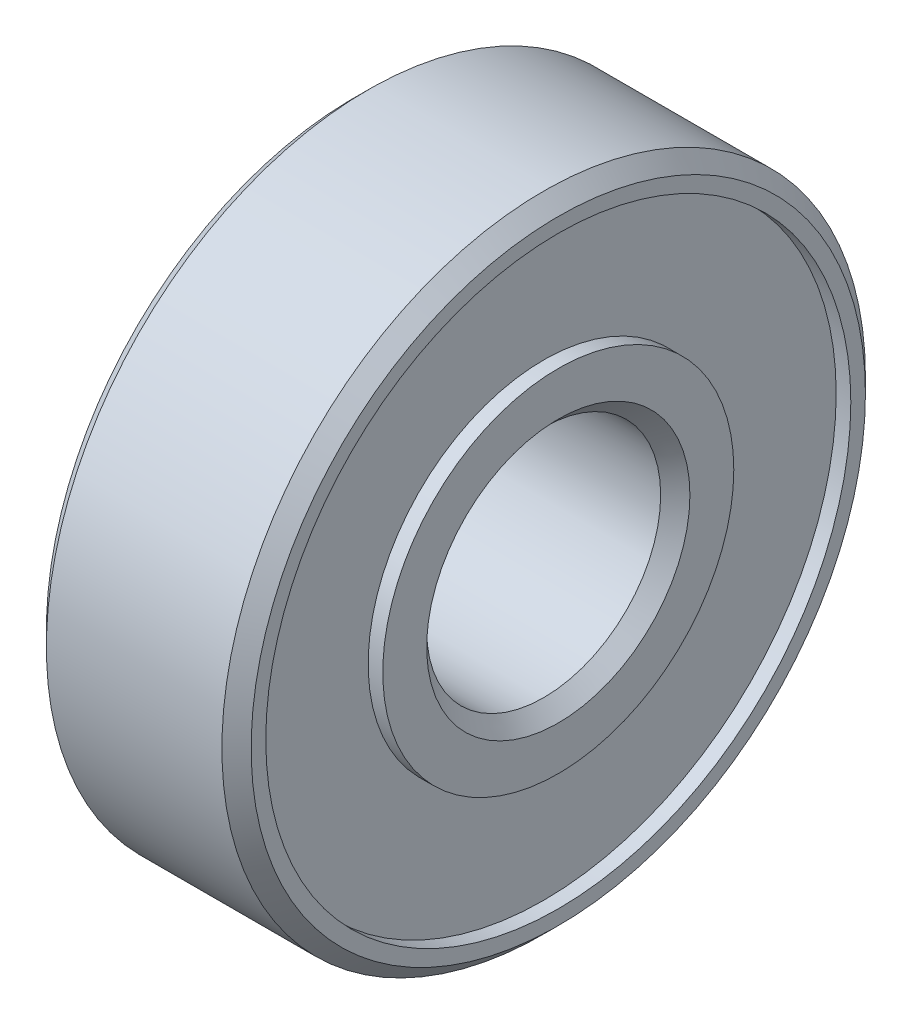
ISO-10303-21;
HEADER;
FILE_DESCRIPTION(('STEP AP214'),'2;1');
FILE_NAME('part.step','',(''),(''),'','','');
FILE_SCHEMA(('AUTOMOTIVE_DESIGN { 1 0 10303 214 1 1 1 1 }'));
ENDSEC;
DATA;
#1=APPLICATION_CONTEXT('core data for automotive mechanical design processes');
#2=APPLICATION_PROTOCOL_DEFINITION('international standard','automotive_design',2000,#1);
#3=PRODUCT_CONTEXT('',#1,'mechanical');
#4=PRODUCT('Part','Part','',(#3));
#5=PRODUCT_RELATED_PRODUCT_CATEGORY('part','',(#4));
#6=PRODUCT_DEFINITION_FORMATION('','',#4);
#7=PRODUCT_DEFINITION_CONTEXT('part definition',#1,'design');
#8=PRODUCT_DEFINITION('design','',#6,#7);
#9=PRODUCT_DEFINITION_SHAPE('','',#8);
#10=(LENGTH_UNIT() NAMED_UNIT(*) SI_UNIT(.MILLI.,.METRE.));
#11=(NAMED_UNIT(*) PLANE_ANGLE_UNIT() SI_UNIT($,.RADIAN.));
#12=(NAMED_UNIT(*) SI_UNIT($,.STERADIAN.) SOLID_ANGLE_UNIT());
#13=UNCERTAINTY_MEASURE_WITH_UNIT(LENGTH_MEASURE(1.E-05),#10,'distance_accuracy_value','');
#14=(GEOMETRIC_REPRESENTATION_CONTEXT(3) GLOBAL_UNCERTAINTY_ASSIGNED_CONTEXT((#13)) GLOBAL_UNIT_ASSIGNED_CONTEXT((#10,
#11,#12)) REPRESENTATION_CONTEXT('',''));
#15=CARTESIAN_POINT('',(0.,0.,0.));
#16=DIRECTION('',(0.,0.,1.));
#17=DIRECTION('',(1.,0.,0.));
#18=AXIS2_PLACEMENT_3D('',#15,#16,#17);
#19=CARTESIAN_POINT('',(-3.,6.,0.));
#20=DIRECTION('',(-1.,0.,0.));
#21=DIRECTION('',(0.,0.,1.));
#22=AXIS2_PLACEMENT_3D('',#19,#20,#21);
#23=PLANE('',#22);
#24=CARTESIAN_POINT('',(-3.,0.,0.));
#25=DIRECTION('',(1.,0.,0.));
#26=DIRECTION('',(0.,0.,-1.));
#27=AXIS2_PLACEMENT_3D('',#24,#25,#26);
#28=CIRCLE('',#27,6.);
#29=CARTESIAN_POINT('',(-3.,0.,-6.));
#30=VERTEX_POINT('',#29);
#31=EDGE_CURVE('E10',#30,#30,#28,.T.);
#32=ORIENTED_EDGE('',*,*,#31,.T.);
#33=EDGE_LOOP('',(#32));
#34=FACE_BOUND('',#33,.T.);
#35=CARTESIAN_POINT('',(-3.,0.,0.));
#36=DIRECTION('',(1.,0.,0.));
#37=DIRECTION('',(0.,0.,-1.));
#38=AXIS2_PLACEMENT_3D('',#35,#36,#37);
#39=CIRCLE('',#38,10.);
#40=CARTESIAN_POINT('',(-3.,0.,-10.));
#41=VERTEX_POINT('',#40);
#42=EDGE_CURVE('E83',#41,#41,#39,.T.);
#43=ORIENTED_EDGE('',*,*,#42,.F.);
#44=EDGE_LOOP('',(#43));
#45=FACE_BOUND('',#44,.T.);
#46=ADVANCED_FACE('F31',(#34,#45),#23,.T.);
#47=CARTESIAN_POINT('',(0.,0.,0.));
#48=DIRECTION('',(1.,0.,0.));
#49=DIRECTION('',(0.,0.,-1.));
#50=AXIS2_PLACEMENT_3D('',#47,#48,#49);
#51=CYLINDRICAL_SURFACE('',#50,6.);
#52=CARTESIAN_POINT('',(-3.5,0.,0.));
#53=DIRECTION('',(1.,0.,0.));
#54=DIRECTION('',(0.,0.,-1.));
#55=AXIS2_PLACEMENT_3D('',#52,#53,#54);
#56=CIRCLE('',#55,6.);
#57=CARTESIAN_POINT('',(-3.5,0.,-6.));
#58=VERTEX_POINT('',#57);
#59=EDGE_CURVE('E37',#58,#58,#56,.T.);
#60=ORIENTED_EDGE('',*,*,#59,.T.);
#61=EDGE_LOOP('',(#60));
#62=FACE_BOUND('',#61,.T.);
#63=ORIENTED_EDGE('',*,*,#31,.F.);
#64=EDGE_LOOP('',(#63));
#65=FACE_BOUND('',#64,.T.);
#66=ADVANCED_FACE('F91',(#62,#65),#51,.T.);
#67=CARTESIAN_POINT('',(-3.5,4.5,0.));
#68=DIRECTION('',(-1.,0.,0.));
#69=DIRECTION('',(0.,0.,1.));
#70=AXIS2_PLACEMENT_3D('',#67,#68,#69);
#71=PLANE('',#70);
#72=CARTESIAN_POINT('',(-3.5,0.,0.));
#73=DIRECTION('',(1.,0.,0.));
#74=DIRECTION('',(0.,0.,-1.));
#75=AXIS2_PLACEMENT_3D('',#72,#73,#74);
#76=CIRCLE('',#75,4.5);
#77=CARTESIAN_POINT('',(-3.5,0.,-4.5));
#78=VERTEX_POINT('',#77);
#79=EDGE_CURVE('E41',#78,#78,#76,.T.);
#80=ORIENTED_EDGE('',*,*,#79,.T.);
#81=EDGE_LOOP('',(#80));
#82=FACE_BOUND('',#81,.T.);
#83=ORIENTED_EDGE('',*,*,#59,.F.);
#84=EDGE_LOOP('',(#83));
#85=FACE_BOUND('',#84,.T.);
#86=ADVANCED_FACE('F95',(#82,#85),#71,.T.);
#87=CARTESIAN_POINT('',(-3.5,0.,0.));
#88=DIRECTION('',(-1.,0.,0.));
#89=DIRECTION('',(0.,0.,1.));
#90=AXIS2_PLACEMENT_3D('',#87,#88,#89);
#91=CONICAL_SURFACE('',#90,4.5,0.785398163397448);
#92=CARTESIAN_POINT('',(-3.,0.,0.));
#93=DIRECTION('',(1.,0.,0.));
#94=DIRECTION('',(0.,0.,-1.));
#95=AXIS2_PLACEMENT_3D('',#92,#93,#94);
#96=CIRCLE('',#95,4.);
#97=CARTESIAN_POINT('',(-3.,0.,-4.));
#98=VERTEX_POINT('',#97);
#99=EDGE_CURVE('E45',#98,#98,#96,.T.);
#100=ORIENTED_EDGE('',*,*,#99,.T.);
#101=EDGE_LOOP('',(#100));
#102=FACE_BOUND('',#101,.T.);
#103=ORIENTED_EDGE('',*,*,#79,.F.);
#104=EDGE_LOOP('',(#103));
#105=FACE_BOUND('',#104,.T.);
#106=ADVANCED_FACE('F99',(#102,#105),#91,.F.);
#107=CARTESIAN_POINT('',(0.,0.,0.));
#108=DIRECTION('',(1.,0.,0.));
#109=DIRECTION('',(0.,0.,-1.));
#110=AXIS2_PLACEMENT_3D('',#107,#108,#109);
#111=CYLINDRICAL_SURFACE('',#110,4.);
#112=CARTESIAN_POINT('',(3.,0.,0.));
#113=DIRECTION('',(1.,0.,0.));
#114=DIRECTION('',(0.,0.,-1.));
#115=AXIS2_PLACEMENT_3D('',#112,#113,#114);
#116=CIRCLE('',#115,4.);
#117=CARTESIAN_POINT('',(3.,0.,-4.));
#118=VERTEX_POINT('',#117);
#119=EDGE_CURVE('E50',#118,#118,#116,.T.);
#120=ORIENTED_EDGE('',*,*,#119,.T.);
#121=EDGE_LOOP('',(#120));
#122=FACE_BOUND('',#121,.T.);
#123=ORIENTED_EDGE('',*,*,#99,.F.);
#124=EDGE_LOOP('',(#123));
#125=FACE_BOUND('',#124,.T.);
#126=ADVANCED_FACE('F106',(#122,#125),#111,.F.);
#127=CARTESIAN_POINT('',(3.,0.,0.));
#128=DIRECTION('',(1.,0.,0.));
#129=DIRECTION('',(0.,0.,-1.));
#130=AXIS2_PLACEMENT_3D('',#127,#128,#129);
#131=CONICAL_SURFACE('',#130,4.,0.785398163397448);
#132=CARTESIAN_POINT('',(3.5,0.,0.));
#133=DIRECTION('',(1.,0.,0.));
#134=DIRECTION('',(0.,0.,-1.));
#135=AXIS2_PLACEMENT_3D('',#132,#133,#134);
#136=CIRCLE('',#135,4.5);
#137=CARTESIAN_POINT('',(3.5,0.,-4.5));
#138=VERTEX_POINT('',#137);
#139=EDGE_CURVE('E53',#138,#138,#136,.T.);
#140=ORIENTED_EDGE('',*,*,#139,.T.);
#141=EDGE_LOOP('',(#140));
#142=FACE_BOUND('',#141,.T.);
#143=ORIENTED_EDGE('',*,*,#119,.F.);
#144=EDGE_LOOP('',(#143));
#145=FACE_BOUND('',#144,.T.);
#146=ADVANCED_FACE('F110',(#142,#145),#131,.F.);
#147=CARTESIAN_POINT('',(3.5,6.,0.));
#148=DIRECTION('',(1.,0.,0.));
#149=DIRECTION('',(0.,0.,-1.));
#150=AXIS2_PLACEMENT_3D('',#147,#148,#149);
#151=PLANE('',#150);
#152=CARTESIAN_POINT('',(3.5,0.,0.));
#153=DIRECTION('',(1.,0.,0.));
#154=DIRECTION('',(0.,0.,-1.));
#155=AXIS2_PLACEMENT_3D('',#152,#153,#154);
#156=CIRCLE('',#155,6.);
#157=CARTESIAN_POINT('',(3.5,0.,-6.));
#158=VERTEX_POINT('',#157);
#159=EDGE_CURVE('E56',#158,#158,#156,.T.);
#160=ORIENTED_EDGE('',*,*,#159,.T.);
#161=EDGE_LOOP('',(#160));
#162=FACE_BOUND('',#161,.T.);
#163=ORIENTED_EDGE('',*,*,#139,.F.);
#164=EDGE_LOOP('',(#163));
#165=FACE_BOUND('',#164,.T.);
#166=ADVANCED_FACE('F114',(#162,#165),#151,.T.);
#167=CARTESIAN_POINT('',(0.,0.,0.));
#168=DIRECTION('',(1.,0.,0.));
#169=DIRECTION('',(0.,0.,-1.));
#170=AXIS2_PLACEMENT_3D('',#167,#168,#169);
#171=CYLINDRICAL_SURFACE('',#170,6.);
#172=CARTESIAN_POINT('',(3.,0.,0.));
#173=DIRECTION('',(1.,0.,0.));
#174=DIRECTION('',(0.,0.,-1.));
#175=AXIS2_PLACEMENT_3D('',#172,#173,#174);
#176=CIRCLE('',#175,6.);
#177=CARTESIAN_POINT('',(3.,0.,-6.));
#178=VERTEX_POINT('',#177);
#179=EDGE_CURVE('E59',#178,#178,#176,.T.);
#180=ORIENTED_EDGE('',*,*,#179,.T.);
#181=EDGE_LOOP('',(#180));
#182=FACE_BOUND('',#181,.T.);
#183=ORIENTED_EDGE('',*,*,#159,.F.);
#184=EDGE_LOOP('',(#183));
#185=FACE_BOUND('',#184,.T.);
#186=ADVANCED_FACE('F118',(#182,#185),#171,.T.);
#187=CARTESIAN_POINT('',(3.,10.,0.));
#188=DIRECTION('',(1.,0.,0.));
#189=DIRECTION('',(0.,0.,-1.));
#190=AXIS2_PLACEMENT_3D('',#187,#188,#189);
#191=PLANE('',#190);
#192=CARTESIAN_POINT('',(3.,0.,0.));
#193=DIRECTION('',(1.,0.,0.));
#194=DIRECTION('',(0.,0.,-1.));
#195=AXIS2_PLACEMENT_3D('',#192,#193,#194);
#196=CIRCLE('',#195,10.);
#197=CARTESIAN_POINT('',(3.,0.,-10.));
#198=VERTEX_POINT('',#197);
#199=EDGE_CURVE('E62',#198,#198,#196,.T.);
#200=ORIENTED_EDGE('',*,*,#199,.T.);
#201=EDGE_LOOP('',(#200));
#202=FACE_BOUND('',#201,.T.);
#203=ORIENTED_EDGE('',*,*,#179,.F.);
#204=EDGE_LOOP('',(#203));
#205=FACE_BOUND('',#204,.T.);
#206=ADVANCED_FACE('F122',(#202,#205),#191,.T.);
#207=CARTESIAN_POINT('',(0.,0.,0.));
#208=DIRECTION('',(1.,0.,0.));
#209=DIRECTION('',(0.,0.,-1.));
#210=AXIS2_PLACEMENT_3D('',#207,#208,#209);
#211=CYLINDRICAL_SURFACE('',#210,10.);
#212=CARTESIAN_POINT('',(3.5,0.,0.));
#213=DIRECTION('',(1.,0.,0.));
#214=DIRECTION('',(0.,0.,-1.));
#215=AXIS2_PLACEMENT_3D('',#212,#213,#214);
#216=CIRCLE('',#215,10.);
#217=CARTESIAN_POINT('',(3.5,0.,-10.));
#218=VERTEX_POINT('',#217);
#219=EDGE_CURVE('E65',#218,#218,#216,.T.);
#220=ORIENTED_EDGE('',*,*,#219,.T.);
#221=EDGE_LOOP('',(#220));
#222=FACE_BOUND('',#221,.T.);
#223=ORIENTED_EDGE('',*,*,#199,.F.);
#224=EDGE_LOOP('',(#223));
#225=FACE_BOUND('',#224,.T.);
#226=ADVANCED_FACE('F126',(#222,#225),#211,.F.);
#227=CARTESIAN_POINT('',(3.5,10.5,0.));
#228=DIRECTION('',(1.,0.,0.));
#229=DIRECTION('',(0.,0.,-1.));
#230=AXIS2_PLACEMENT_3D('',#227,#228,#229);
#231=PLANE('',#230);
#232=CARTESIAN_POINT('',(3.5,0.,0.));
#233=DIRECTION('',(1.,0.,0.));
#234=DIRECTION('',(0.,0.,-1.));
#235=AXIS2_PLACEMENT_3D('',#232,#233,#234);
#236=CIRCLE('',#235,10.5);
#237=CARTESIAN_POINT('',(3.5,0.,-10.5));
#238=VERTEX_POINT('',#237);
#239=EDGE_CURVE('E68',#238,#238,#236,.T.);
#240=ORIENTED_EDGE('',*,*,#239,.T.);
#241=EDGE_LOOP('',(#240));
#242=FACE_BOUND('',#241,.T.);
#243=ORIENTED_EDGE('',*,*,#219,.F.);
#244=EDGE_LOOP('',(#243));
#245=FACE_BOUND('',#244,.T.);
#246=ADVANCED_FACE('F130',(#242,#245),#231,.T.);
#247=CARTESIAN_POINT('',(3.5,0.,0.));
#248=DIRECTION('',(-1.,0.,0.));
#249=DIRECTION('',(0.,0.,1.));
#250=AXIS2_PLACEMENT_3D('',#247,#248,#249);
#251=CONICAL_SURFACE('',#250,10.5,0.785398163397449);
#252=CARTESIAN_POINT('',(3.,0.,0.));
#253=DIRECTION('',(1.,0.,0.));
#254=DIRECTION('',(0.,0.,-1.));
#255=AXIS2_PLACEMENT_3D('',#252,#253,#254);
#256=CIRCLE('',#255,11.);
#257=CARTESIAN_POINT('',(3.,0.,-11.));
#258=VERTEX_POINT('',#257);
#259=EDGE_CURVE('E71',#258,#258,#256,.T.);
#260=ORIENTED_EDGE('',*,*,#259,.T.);
#261=EDGE_LOOP('',(#260));
#262=FACE_BOUND('',#261,.T.);
#263=ORIENTED_EDGE('',*,*,#239,.F.);
#264=EDGE_LOOP('',(#263));
#265=FACE_BOUND('',#264,.T.);
#266=ADVANCED_FACE('F134',(#262,#265),#251,.T.);
#267=CARTESIAN_POINT('',(0.,0.,0.));
#268=DIRECTION('',(1.,0.,0.));
#269=DIRECTION('',(0.,0.,-1.));
#270=AXIS2_PLACEMENT_3D('',#267,#268,#269);
#271=CYLINDRICAL_SURFACE('',#270,11.);
#272=CARTESIAN_POINT('',(-3.,0.,0.));
#273=DIRECTION('',(1.,0.,0.));
#274=DIRECTION('',(0.,0.,-1.));
#275=AXIS2_PLACEMENT_3D('',#272,#273,#274);
#276=CIRCLE('',#275,11.);
#277=CARTESIAN_POINT('',(-3.,0.,-11.));
#278=VERTEX_POINT('',#277);
#279=EDGE_CURVE('E74',#278,#278,#276,.T.);
#280=ORIENTED_EDGE('',*,*,#279,.T.);
#281=EDGE_LOOP('',(#280));
#282=FACE_BOUND('',#281,.T.);
#283=ORIENTED_EDGE('',*,*,#259,.F.);
#284=EDGE_LOOP('',(#283));
#285=FACE_BOUND('',#284,.T.);
#286=ADVANCED_FACE('F138',(#282,#285),#271,.T.);
#287=CARTESIAN_POINT('',(-3.,0.,0.));
#288=DIRECTION('',(1.,0.,0.));
#289=DIRECTION('',(0.,0.,-1.));
#290=AXIS2_PLACEMENT_3D('',#287,#288,#289);
#291=CONICAL_SURFACE('',#290,11.,0.785398163397449);
#292=CARTESIAN_POINT('',(-3.5,0.,0.));
#293=DIRECTION('',(1.,0.,0.));
#294=DIRECTION('',(0.,0.,-1.));
#295=AXIS2_PLACEMENT_3D('',#292,#293,#294);
#296=CIRCLE('',#295,10.5);
#297=CARTESIAN_POINT('',(-3.5,0.,-10.5));
#298=VERTEX_POINT('',#297);
#299=EDGE_CURVE('E77',#298,#298,#296,.T.);
#300=ORIENTED_EDGE('',*,*,#299,.T.);
#301=EDGE_LOOP('',(#300));
#302=FACE_BOUND('',#301,.T.);
#303=ORIENTED_EDGE('',*,*,#279,.F.);
#304=EDGE_LOOP('',(#303));
#305=FACE_BOUND('',#304,.T.);
#306=ADVANCED_FACE('F142',(#302,#305),#291,.T.);
#307=CARTESIAN_POINT('',(-3.5,10.,0.));
#308=DIRECTION('',(-1.,0.,0.));
#309=DIRECTION('',(0.,0.,1.));
#310=AXIS2_PLACEMENT_3D('',#307,#308,#309);
#311=PLANE('',#310);
#312=CARTESIAN_POINT('',(-3.5,0.,0.));
#313=DIRECTION('',(1.,0.,0.));
#314=DIRECTION('',(0.,0.,-1.));
#315=AXIS2_PLACEMENT_3D('',#312,#313,#314);
#316=CIRCLE('',#315,10.);
#317=CARTESIAN_POINT('',(-3.5,0.,-10.));
#318=VERTEX_POINT('',#317);
#319=EDGE_CURVE('E80',#318,#318,#316,.T.);
#320=ORIENTED_EDGE('',*,*,#319,.T.);
#321=EDGE_LOOP('',(#320));
#322=FACE_BOUND('',#321,.T.);
#323=ORIENTED_EDGE('',*,*,#299,.F.);
#324=EDGE_LOOP('',(#323));
#325=FACE_BOUND('',#324,.T.);
#326=ADVANCED_FACE('F146',(#322,#325),#311,.T.);
#327=CARTESIAN_POINT('',(0.,0.,0.));
#328=DIRECTION('',(1.,0.,0.));
#329=DIRECTION('',(0.,0.,-1.));
#330=AXIS2_PLACEMENT_3D('',#327,#328,#329);
#331=CYLINDRICAL_SURFACE('',#330,10.);
#332=ORIENTED_EDGE('',*,*,#42,.T.);
#333=EDGE_LOOP('',(#332));
#334=FACE_BOUND('',#333,.T.);
#335=ORIENTED_EDGE('',*,*,#319,.F.);
#336=EDGE_LOOP('',(#335));
#337=FACE_BOUND('',#336,.T.);
#338=ADVANCED_FACE('F87',(#334,#337),#331,.F.);
#339=CLOSED_SHELL('',(#46,#66,#86,#106,#126,#146,#166,#186,#206,#226,#246,#266,#286,#306,#326,#338));
#340=MANIFOLD_SOLID_BREP('B2',#339);
#341=ADVANCED_BREP_SHAPE_REPRESENTATION('',(#18,#340),#14);
#342=SHAPE_DEFINITION_REPRESENTATION(#9,#341);
ENDSEC;
END-ISO-10303-21;
